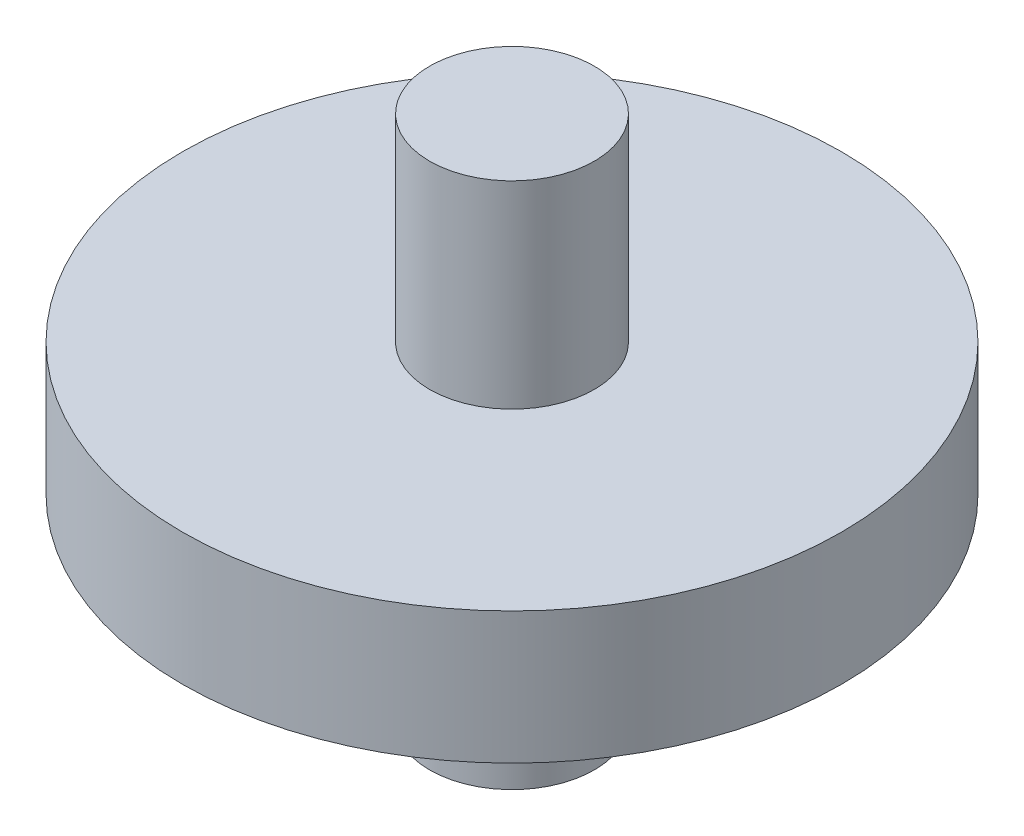
ISO-10303-21;
HEADER;
FILE_DESCRIPTION(('STEP AP214'),'2;1');
FILE_NAME('part.step','',(''),(''),'','','');
FILE_SCHEMA(('AUTOMOTIVE_DESIGN { 1 0 10303 214 1 1 1 1 }'));
ENDSEC;
DATA;
#1=APPLICATION_CONTEXT('core data for automotive mechanical design processes');
#2=APPLICATION_PROTOCOL_DEFINITION('international standard','automotive_design',2000,#1);
#3=PRODUCT_CONTEXT('',#1,'mechanical');
#4=PRODUCT('Part','Part','',(#3));
#5=PRODUCT_RELATED_PRODUCT_CATEGORY('part','',(#4));
#6=PRODUCT_DEFINITION_FORMATION('','',#4);
#7=PRODUCT_DEFINITION_CONTEXT('part definition',#1,'design');
#8=PRODUCT_DEFINITION('design','',#6,#7);
#9=PRODUCT_DEFINITION_SHAPE('','',#8);
#10=(LENGTH_UNIT() NAMED_UNIT(*) SI_UNIT(.MILLI.,.METRE.));
#11=(NAMED_UNIT(*) PLANE_ANGLE_UNIT() SI_UNIT($,.RADIAN.));
#12=(NAMED_UNIT(*) SI_UNIT($,.STERADIAN.) SOLID_ANGLE_UNIT());
#13=UNCERTAINTY_MEASURE_WITH_UNIT(LENGTH_MEASURE(1.E-05),#10,'distance_accuracy_value','');
#14=(GEOMETRIC_REPRESENTATION_CONTEXT(3) GLOBAL_UNCERTAINTY_ASSIGNED_CONTEXT((#13)) GLOBAL_UNIT_ASSIGNED_CONTEXT((#10,
#11,#12)) REPRESENTATION_CONTEXT('',''));
#15=CARTESIAN_POINT('',(0.,0.,0.));
#16=DIRECTION('',(0.,0.,1.));
#17=DIRECTION('',(1.,0.,0.));
#18=AXIS2_PLACEMENT_3D('',#15,#16,#17);
#19=CARTESIAN_POINT('',(0.,20.,0.));
#20=DIRECTION('',(0.,-1.,0.));
#21=DIRECTION('',(0.,0.,-1.));
#22=AXIS2_PLACEMENT_3D('',#19,#20,#21);
#23=CYLINDRICAL_SURFACE('',#22,50.);
#24=CARTESIAN_POINT('',(0.,20.,0.));
#25=DIRECTION('',(0.,1.,0.));
#26=DIRECTION('',(0.,0.,1.));
#27=AXIS2_PLACEMENT_3D('',#24,#25,#26);
#28=CIRCLE('',#27,50.);
#29=CARTESIAN_POINT('',(0.,20.,50.));
#30=VERTEX_POINT('',#29);
#31=EDGE_CURVE('E44',#30,#30,#28,.T.);
#32=ORIENTED_EDGE('',*,*,#31,.F.);
#33=EDGE_LOOP('',(#32));
#34=FACE_BOUND('',#33,.T.);
#35=CARTESIAN_POINT('',(0.,0.,0.));
#36=DIRECTION('',(0.,1.,0.));
#37=DIRECTION('',(0.,0.,1.));
#38=AXIS2_PLACEMENT_3D('',#35,#36,#37);
#39=CIRCLE('',#38,50.);
#40=CARTESIAN_POINT('',(0.,0.,50.));
#41=VERTEX_POINT('',#40);
#42=EDGE_CURVE('E49',#41,#41,#39,.T.);
#43=ORIENTED_EDGE('',*,*,#42,.T.);
#44=EDGE_LOOP('',(#43));
#45=FACE_BOUND('',#44,.T.);
#46=ADVANCED_FACE('F37',(#34,#45),#23,.T.);
#47=CARTESIAN_POINT('',(0.,20.,0.));
#48=DIRECTION('',(0.,1.,0.));
#49=DIRECTION('',(0.,0.,1.));
#50=AXIS2_PLACEMENT_3D('',#47,#48,#49);
#51=PLANE('',#50);
#52=CARTESIAN_POINT('',(0.,20.,0.));
#53=DIRECTION('',(0.,1.,0.));
#54=DIRECTION('',(0.,0.,1.));
#55=AXIS2_PLACEMENT_3D('',#52,#53,#54);
#56=CIRCLE('',#55,12.5);
#57=CARTESIAN_POINT('',(0.,20.,12.5));
#58=VERTEX_POINT('',#57);
#59=EDGE_CURVE('E10',#58,#58,#56,.T.);
#60=ORIENTED_EDGE('',*,*,#59,.F.);
#61=EDGE_LOOP('',(#60));
#62=FACE_BOUND('',#61,.T.);
#63=ORIENTED_EDGE('',*,*,#31,.T.);
#64=EDGE_LOOP('',(#63));
#65=FACE_BOUND('',#64,.T.);
#66=ADVANCED_FACE('F82',(#62,#65),#51,.T.);
#67=CARTESIAN_POINT('',(0.,0.,0.));
#68=DIRECTION('',(0.,1.,0.));
#69=DIRECTION('',(0.,0.,1.));
#70=AXIS2_PLACEMENT_3D('',#67,#68,#69);
#71=PLANE('',#70);
#72=CARTESIAN_POINT('',(0.,0.,0.));
#73=DIRECTION('',(0.,1.,0.));
#74=DIRECTION('',(0.,0.,1.));
#75=AXIS2_PLACEMENT_3D('',#72,#73,#74);
#76=CIRCLE('',#75,12.5);
#77=CARTESIAN_POINT('',(0.,0.,12.5));
#78=VERTEX_POINT('',#77);
#79=EDGE_CURVE('E40',#78,#78,#76,.T.);
#80=ORIENTED_EDGE('',*,*,#79,.T.);
#81=EDGE_LOOP('',(#80));
#82=FACE_BOUND('',#81,.T.);
#83=ORIENTED_EDGE('',*,*,#42,.F.);
#84=EDGE_LOOP('',(#83));
#85=FACE_BOUND('',#84,.T.);
#86=ADVANCED_FACE('F87',(#82,#85),#71,.F.);
#87=CARTESIAN_POINT('',(0.,-30.,0.));
#88=DIRECTION('',(0.,1.,0.));
#89=DIRECTION('',(0.,0.,1.));
#90=AXIS2_PLACEMENT_3D('',#87,#88,#89);
#91=PLANE('',#90);
#92=CARTESIAN_POINT('',(0.,-30.,0.));
#93=DIRECTION('',(0.,1.,0.));
#94=DIRECTION('',(0.,0.,1.));
#95=AXIS2_PLACEMENT_3D('',#92,#93,#94);
#96=CIRCLE('',#95,12.5);
#97=CARTESIAN_POINT('',(0.,-30.,12.5));
#98=VERTEX_POINT('',#97);
#99=EDGE_CURVE('E52',#98,#98,#96,.T.);
#100=ORIENTED_EDGE('',*,*,#99,.F.);
#101=EDGE_LOOP('',(#100));
#102=FACE_BOUND('',#101,.T.);
#103=ADVANCED_FACE('F78',(#102),#91,.F.);
#104=CARTESIAN_POINT('',(0.,-30.,0.));
#105=DIRECTION('',(0.,1.,0.));
#106=DIRECTION('',(0.,0.,1.));
#107=AXIS2_PLACEMENT_3D('',#104,#105,#106);
#108=CYLINDRICAL_SURFACE('',#107,12.5);
#109=ORIENTED_EDGE('',*,*,#99,.T.);
#110=EDGE_LOOP('',(#109));
#111=FACE_BOUND('',#110,.T.);
#112=ORIENTED_EDGE('',*,*,#79,.F.);
#113=EDGE_LOOP('',(#112));
#114=FACE_BOUND('',#113,.T.);
#115=ADVANCED_FACE('F71',(#111,#114),#108,.T.);
#116=ORIENTED_EDGE('',*,*,#59,.T.);
#117=EDGE_LOOP('',(#116));
#118=FACE_BOUND('',#117,.T.);
#119=CARTESIAN_POINT('',(0.,50.,0.));
#120=DIRECTION('',(0.,1.,0.));
#121=DIRECTION('',(0.,0.,1.));
#122=AXIS2_PLACEMENT_3D('',#119,#120,#121);
#123=CIRCLE('',#122,12.5);
#124=CARTESIAN_POINT('',(0.,50.,12.5));
#125=VERTEX_POINT('',#124);
#126=EDGE_CURVE('E61',#125,#125,#123,.T.);
#127=ORIENTED_EDGE('',*,*,#126,.F.);
#128=EDGE_LOOP('',(#127));
#129=FACE_BOUND('',#128,.T.);
#130=ADVANCED_FACE('F69',(#118,#129),#108,.T.);
#131=CARTESIAN_POINT('',(0.,50.,0.));
#132=DIRECTION('',(0.,1.,0.));
#133=DIRECTION('',(0.,0.,1.));
#134=AXIS2_PLACEMENT_3D('',#131,#132,#133);
#135=PLANE('',#134);
#136=ORIENTED_EDGE('',*,*,#126,.T.);
#137=EDGE_LOOP('',(#136));
#138=FACE_BOUND('',#137,.T.);
#139=ADVANCED_FACE('F67',(#138),#135,.T.);
#140=CLOSED_SHELL('',(#46,#66,#86,#103,#115,#130,#139));
#141=MANIFOLD_SOLID_BREP('B2',#140);
#142=ADVANCED_BREP_SHAPE_REPRESENTATION('',(#18,#141),#14);
#143=SHAPE_DEFINITION_REPRESENTATION(#9,#142);
ENDSEC;
END-ISO-10303-21;
